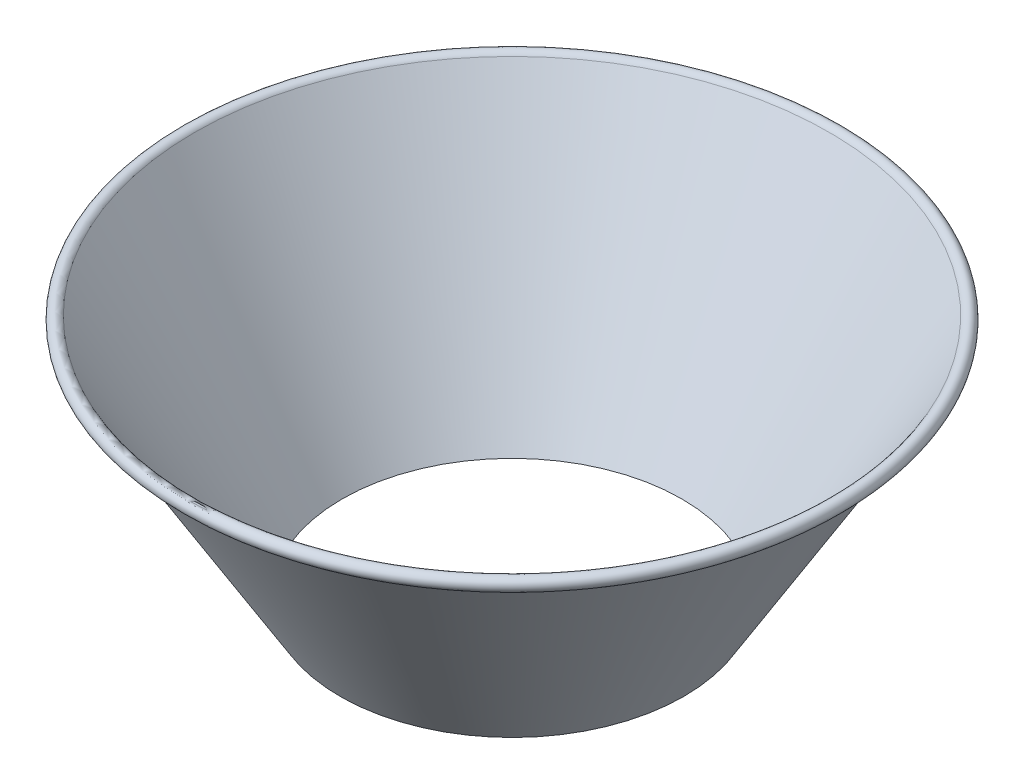
ISO-10303-21;
HEADER;
FILE_DESCRIPTION(('STEP AP214'),'2;1');
FILE_NAME('part.step','',(''),(''),'','','');
FILE_SCHEMA(('AUTOMOTIVE_DESIGN { 1 0 10303 214 1 1 1 1 }'));
ENDSEC;
DATA;
#1=APPLICATION_CONTEXT('core data for automotive mechanical design processes');
#2=APPLICATION_PROTOCOL_DEFINITION('international standard','automotive_design',2000,#1);
#3=PRODUCT_CONTEXT('',#1,'mechanical');
#4=PRODUCT('Part','Part','',(#3));
#5=PRODUCT_RELATED_PRODUCT_CATEGORY('part','',(#4));
#6=PRODUCT_DEFINITION_FORMATION('','',#4);
#7=PRODUCT_DEFINITION_CONTEXT('part definition',#1,'design');
#8=PRODUCT_DEFINITION('design','',#6,#7);
#9=PRODUCT_DEFINITION_SHAPE('','',#8);
#10=(LENGTH_UNIT() NAMED_UNIT(*) SI_UNIT(.MILLI.,.METRE.));
#11=(NAMED_UNIT(*) PLANE_ANGLE_UNIT() SI_UNIT($,.RADIAN.));
#12=(NAMED_UNIT(*) SI_UNIT($,.STERADIAN.) SOLID_ANGLE_UNIT());
#13=UNCERTAINTY_MEASURE_WITH_UNIT(LENGTH_MEASURE(1.E-05),#10,'distance_accuracy_value','');
#14=(GEOMETRIC_REPRESENTATION_CONTEXT(3) GLOBAL_UNCERTAINTY_ASSIGNED_CONTEXT((#13)) GLOBAL_UNIT_ASSIGNED_CONTEXT((#10,
#11,#12)) REPRESENTATION_CONTEXT('',''));
#15=CARTESIAN_POINT('',(0.,0.,0.));
#16=DIRECTION('',(0.,0.,1.));
#17=DIRECTION('',(1.,0.,0.));
#18=AXIS2_PLACEMENT_3D('',#15,#16,#17);
#19=CARTESIAN_POINT('',(0.,74.7395,0.));
#20=DIRECTION('',(0.,1.,0.));
#21=DIRECTION('',(-1.,0.,0.));
#22=AXIS2_PLACEMENT_3D('',#19,#20,#21);
#23=TOROIDAL_SURFACE('',#22,71.5645,1.46050000000002);
#24=CARTESIAN_POINT('',(0.,73.279,0.));
#25=DIRECTION('',(0.,1.,0.));
#26=DIRECTION('',(-1.,0.,0.));
#27=AXIS2_PLACEMENT_3D('',#24,#25,#26);
#28=CIRCLE('',#27,71.5645);
#29=CARTESIAN_POINT('',(-71.5645,73.279,0.));
#30=VERTEX_POINT('',#29);
#31=EDGE_CURVE('E72',#30,#30,#28,.T.);
#32=ORIENTED_EDGE('',*,*,#31,.T.);
#33=EDGE_LOOP('',(#32));
#34=FACE_BOUND('',#33,.T.);
#35=CARTESIAN_POINT('',(0.,75.4946142821155,0.));
#36=DIRECTION('',(0.,1.,0.));
#37=DIRECTION('',(-1.,0.,0.));
#38=AXIS2_PLACEMENT_3D('',#35,#36,#37);
#39=CIRCLE('',#38,70.3143549400388);
#40=CARTESIAN_POINT('',(-70.3143549400389,75.4946142821155,0.));
#41=VERTEX_POINT('',#40);
#42=EDGE_CURVE('E64',#41,#41,#39,.T.);
#43=ORIENTED_EDGE('',*,*,#42,.F.);
#44=EDGE_LOOP('',(#43));
#45=FACE_BOUND('',#44,.T.);
#46=ADVANCED_FACE('F40',(#34,#45),#23,.T.);
#47=CARTESIAN_POINT('',(0.,-18.669,0.));
#48=DIRECTION('',(0.,1.,0.));
#49=DIRECTION('',(-1.,0.,0.));
#50=AXIS2_PLACEMENT_3D('',#47,#48,#49);
#51=CONICAL_SURFACE('',#50,13.4375233807888,0.54337111564832);
#52=CARTESIAN_POINT('',(0.,21.4450023454756,0.));
#53=DIRECTION('',(0.,1.,0.));
#54=DIRECTION('',(0.,0.,1.));
#55=AXIS2_PLACEMENT_3D('',#52,#53,#54);
#56=CIRCLE('',#55,37.6672364389069);
#57=CARTESIAN_POINT('',(0.,21.4450023454756,37.667236438907));
#58=VERTEX_POINT('',#57);
#59=EDGE_CURVE('E69',#58,#58,#56,.T.);
#60=ORIENTED_EDGE('',*,*,#59,.F.);
#61=EDGE_LOOP('',(#60));
#62=FACE_BOUND('',#61,.T.);
#63=ORIENTED_EDGE('',*,*,#42,.T.);
#64=EDGE_LOOP('',(#63));
#65=FACE_BOUND('',#64,.T.);
#66=ADVANCED_FACE('F86',(#62,#65),#51,.F.);
#67=CARTESIAN_POINT('',(0.,75.2976279476506,0.));
#68=DIRECTION('',(0.,1.,0.));
#69=DIRECTION('',(-1.,0.,0.));
#70=AXIS2_PLACEMENT_3D('',#67,#68,#69);
#71=CONICAL_SURFACE('',#70,70.6404797382896,0.54337111564835);
#72=CARTESIAN_POINT('',(-38.0876548150612,168.081843546247,120.823003171525));
#73=CARTESIAN_POINT('',(-38.0876548150612,165.648551217745,119.281925192194));
#74=CARTESIAN_POINT('',(-38.0876548150612,163.216445597273,117.738971313603));
#75=CARTESIAN_POINT('',(-38.0876548150612,158.354939923969,114.648793918809));
#76=CARTESIAN_POINT('',(-38.0876548150612,155.925539877974,113.10157039185));
#77=CARTESIAN_POINT('',(-38.0876548150612,151.067729864395,110.001028867973));
#78=CARTESIAN_POINT('',(-38.0876548150612,148.63932248566,108.447706814018));
#79=CARTESIAN_POINT('',(-38.0876548150612,143.785983873332,105.335648390206));
#80=CARTESIAN_POINT('',(-38.0876548150612,141.361052634631,103.776912028318));
#81=CARTESIAN_POINT('',(-38.0876548150612,136.465336129185,100.621171617786));
#82=CARTESIAN_POINT('',(-38.0876548150612,133.994633245946,99.0240397281572));
#83=CARTESIAN_POINT('',(-38.0876548150612,129.057982270074,95.8224217122467));
#84=CARTESIAN_POINT('',(-38.0876548150612,126.592034195362,94.2179355583255));
#85=CARTESIAN_POINT('',(-38.0876548150612,121.667705356048,91.0018061663002));
#86=CARTESIAN_POINT('',(-38.0876548150612,119.209320031035,89.3901699129933));
#87=CARTESIAN_POINT('',(-38.0876548150612,114.299059973019,86.1570739835746));
#88=CARTESIAN_POINT('',(-38.0876548150612,111.847185154128,84.5356144379904));
#89=CARTESIAN_POINT('',(-38.0876548150612,107.691578120333,81.7733370093469));
#90=CARTESIAN_POINT('',(-38.0876548150612,105.985874445971,80.6354849650351));
#91=CARTESIAN_POINT('',(-38.0876548150612,102.578700330236,78.3534566396694));
#92=CARTESIAN_POINT('',(-38.0876548150612,100.877229890383,77.2092803563468));
#93=CARTESIAN_POINT('',(-38.0876548150612,97.4789926877367,74.9137084242104));
#94=CARTESIAN_POINT('',(-38.0876548150612,95.7822262588689,73.7623122808913));
#95=CARTESIAN_POINT('',(-38.0876548150612,92.3942223841081,71.451411131646));
#96=CARTESIAN_POINT('',(-38.0876548150612,90.7029849368961,70.2919061276548));
#97=CARTESIAN_POINT('',(-38.0876548150612,87.3219156311028,67.9601997255355));
#98=CARTESIAN_POINT('',(-38.0876548150612,85.6321026309994,66.7879709667249));
#99=CARTESIAN_POINT('',(-38.0876548150612,82.2599546885567,64.4327941320201));
#100=CARTESIAN_POINT('',(-38.0876548150612,80.5776197568551,63.2498460408844));
#101=CARTESIAN_POINT('',(-38.0876548150612,77.2221373154345,60.8718106736305));
#102=CARTESIAN_POINT('',(-38.0876548150612,75.5489877421685,59.6767263116331));
#103=CARTESIAN_POINT('',(-38.0876548150612,72.2131348110702,57.2720641664877));
#104=CARTESIAN_POINT('',(-38.0876548150612,70.5504314165469,56.0624864342891));
#105=CARTESIAN_POINT('',(-38.0876548150612,67.2611577528088,53.6435882695965));
#106=CARTESIAN_POINT('',(-38.0876548150612,65.6344100866802,52.4345093868182));
#107=CARTESIAN_POINT('',(-38.0876548150612,62.3957130032486,49.9966148906589));
#108=CARTESIAN_POINT('',(-38.0876548150612,60.7837638252043,48.7677989590535));
#109=CARTESIAN_POINT('',(-38.0876548150612,57.5765159062242,46.285252908823));
#110=CARTESIAN_POINT('',(-38.0876548150612,55.9812355222851,45.0314989979931));
#111=CARTESIAN_POINT('',(-38.0876548150612,53.6056695503966,43.1292605938618));
#112=CARTESIAN_POINT('',(-38.0876548150612,52.8167179509097,42.4915892528432));
#113=CARTESIAN_POINT('',(-38.0876548150612,51.245362842905,41.2082341776631));
#114=CARTESIAN_POINT('',(-38.0876548150612,50.4629592753172,40.5625505159113));
#115=CARTESIAN_POINT('',(-38.0876548150612,48.90970279517,39.2657102940267));
#116=CARTESIAN_POINT('',(-38.0876548150612,48.1388106833562,38.6146007211529));
#117=CARTESIAN_POINT('',(-38.0876548150612,46.6054343817125,37.3025395351501));
#118=CARTESIAN_POINT('',(-38.0876548150612,45.8429502201257,36.6415878889783));
#119=CARTESIAN_POINT('',(-38.0876548150612,44.327488840679,35.3085081185429));
#120=CARTESIAN_POINT('',(-38.0876548150612,43.5745138747313,34.6363774311122));
#121=CARTESIAN_POINT('',(-38.0876548150612,42.0798092000607,33.2797210155235));
#122=CARTESIAN_POINT('',(-38.0876548150612,41.3380793916203,32.5951953973967));
#123=CARTESIAN_POINT('',(-38.0876548150612,39.8690751711976,31.2133739506006));
#124=CARTESIAN_POINT('',(-38.0876548150612,39.1417773879191,30.5161030099));
#125=CARTESIAN_POINT('',(-38.0876548150612,37.7026087882811,29.1057224812742));
#126=CARTESIAN_POINT('',(-38.0876548150612,36.9907386001211,28.3926122507708));
#127=CARTESIAN_POINT('',(-38.0876548150612,35.5857654152034,26.9487713188204));
#128=CARTESIAN_POINT('',(-38.0876548150612,34.8926535854577,26.2180492281139));
#129=CARTESIAN_POINT('',(-38.0876548150612,33.5286480450629,24.7362133011933));
#130=CARTESIAN_POINT('',(-38.0876548150612,32.8577514147858,23.9851021684063));
#131=CARTESIAN_POINT('',(-38.0876548150612,32.0074562921743,22.9985014779341));
#132=CARTESIAN_POINT('',(-38.0876548150612,31.8156828965234,22.7736314110162));
#133=CARTESIAN_POINT('',(-38.0876548150612,31.4346035916423,22.3217873230872));
#134=CARTESIAN_POINT('',(-38.0876548150612,31.2452978094343,22.0948131947892));
#135=CARTESIAN_POINT('',(-38.0876548150612,30.8692839239541,21.6386519023495));
#136=CARTESIAN_POINT('',(-38.0876548150612,30.6825763068603,21.4094643372598));
#137=CARTESIAN_POINT('',(-38.0876548150612,30.3119668670527,20.9488378900014));
#138=CARTESIAN_POINT('',(-38.0876548150612,30.1280650127229,20.717399033249));
#139=CARTESIAN_POINT('',(-38.0876548150612,29.5806917865106,20.0193952128081));
#140=CARTESIAN_POINT('',(-38.0876548150612,29.2216888608861,19.5493076875629));
#141=CARTESIAN_POINT('',(-38.0876548150612,28.5172538154346,18.5990855641504));
#142=CARTESIAN_POINT('',(-38.0876548150612,28.1718211976454,18.1189513356395));
#143=CARTESIAN_POINT('',(-38.0876548150612,27.4995744361501,17.1524583187397));
#144=CARTESIAN_POINT('',(-38.0876548150612,27.172616106387,16.6662000825786));
#145=CARTESIAN_POINT('',(-38.0876548150612,26.5359991045371,15.6824348622619));
#146=CARTESIAN_POINT('',(-38.0876548150612,26.2263410227084,15.1849274951158));
#147=CARTESIAN_POINT('',(-38.0876548150612,25.62690664767,14.1782522848301));
#148=CARTESIAN_POINT('',(-38.0876548150612,25.3371238944485,13.6690883028568));
#149=CARTESIAN_POINT('',(-38.0876548150612,24.7801974310848,12.6385812415258));
#150=CARTESIAN_POINT('',(-38.0876548150612,24.5130509286648,12.1172396744756));
#151=CARTESIAN_POINT('',(-38.0876548150612,23.9400087042496,10.9282362893786));
#152=CARTESIAN_POINT('',(-38.0876548150612,23.6414652653594,10.2569943591806));
#153=CARTESIAN_POINT('',(-38.0876548150612,23.0918023706047,8.89535603427112));
#154=CARTESIAN_POINT('',(-38.0876548150612,22.8406746224838,8.20496301305006));
#155=CARTESIAN_POINT('',(-38.0876548150612,22.3934106131096,6.80768301408861));
#156=CARTESIAN_POINT('',(-38.0876548150612,22.1971860298175,6.10082453208847));
#157=CARTESIAN_POINT('',(-38.0876548150612,21.8660995361788,4.67260139782912));
#158=CARTESIAN_POINT('',(-38.0876548150612,21.7312377000805,3.95123672801865));
#159=CARTESIAN_POINT('',(-38.0876548150612,21.5785884070241,2.8587206712058));
#160=CARTESIAN_POINT('',(-38.0876548150612,21.5358914712146,2.49091772781046));
#161=CARTESIAN_POINT('',(-38.0876548150612,21.4679950496432,1.75371420860953));
#162=CARTESIAN_POINT('',(-38.0876548150612,21.4427934736389,1.38431382896435));
#163=CARTESIAN_POINT('',(-38.0876548150612,21.4101881093258,0.644710053627098));
#164=CARTESIAN_POINT('',(-38.0876548150612,21.4027853865662,0.27450661118658));
#165=CARTESIAN_POINT('',(-38.0876548150612,21.4058635883615,-0.465784828071986));
#166=CARTESIAN_POINT('',(-38.0876548150612,21.4163425347696,-0.835872833130432));
#167=CARTESIAN_POINT('',(-38.0876548150612,21.4550805517603,-1.57549750378557));
#168=CARTESIAN_POINT('',(-38.0876548150612,21.4833576986873,-1.94503322553982));
#169=CARTESIAN_POINT('',(-38.0876548150612,21.5573635637012,-2.68230918303501));
#170=CARTESIAN_POINT('',(-38.0876548150612,21.6030915844276,-3.05004948992848));
#171=CARTESIAN_POINT('',(-38.0876548150612,21.7657485021896,-4.14954741396918));
#172=CARTESIAN_POINT('',(-38.0876548150612,21.9081544416412,-4.87765883774081));
#173=CARTESIAN_POINT('',(-38.0876548150612,22.286713845738,-6.45014912277065));
#174=CARTESIAN_POINT('',(-38.0876548150612,22.5352281696663,-7.29151420852141));
#175=CARTESIAN_POINT('',(-38.0876548150612,23.1072123330818,-8.94859944125409));
#176=CARTESIAN_POINT('',(-38.0876548150612,23.430722530745,-9.7643055107449));
#177=CARTESIAN_POINT('',(-38.0876548150612,23.9632573727241,-10.9676286382808));
#178=CARTESIAN_POINT('',(-38.0876548150612,24.1489015353092,-11.36583492349));
#179=CARTESIAN_POINT('',(-38.0876548150612,24.5344190314017,-12.1551061446125));
#180=CARTESIAN_POINT('',(-38.0876548150612,24.7342861317781,-12.5461741155871));
#181=CARTESIAN_POINT('',(-38.0876548150612,25.1469691607501,-13.3213979739704));
#182=CARTESIAN_POINT('',(-38.0876548150612,25.3597852401153,-13.7055537808306));
#183=CARTESIAN_POINT('',(-38.0876548150612,25.7971716602247,-14.467179829362));
#184=CARTESIAN_POINT('',(-38.0876548150612,26.0217438238315,-14.8446490220101));
#185=CARTESIAN_POINT('',(-38.0876548150612,26.5521746246227,-15.7081245746477));
#186=CARTESIAN_POINT('',(-38.0876548150612,26.8617967781157,-16.1918197574383));
#187=CARTESIAN_POINT('',(-38.0876548150612,27.4969698248948,-17.1486733667581));
#188=CARTESIAN_POINT('',(-38.0876548150612,27.8225224516449,-17.6218306384235));
#189=CARTESIAN_POINT('',(-38.0876548150612,28.4877183939495,-18.5583560295845));
#190=CARTESIAN_POINT('',(-38.0876548150612,28.8273663966491,-19.0217208142102));
#191=CARTESIAN_POINT('',(-38.0876548150612,29.5190087914117,-19.93915807313));
#192=CARTESIAN_POINT('',(-38.0876548150612,29.8710039378488,-20.3932299769633));
#193=CARTESIAN_POINT('',(-38.0876548150612,30.9445786702881,-21.7440676898729));
#194=CARTESIAN_POINT('',(-38.0876548150612,31.682572602163,-22.6278205644663));
#195=CARTESIAN_POINT('',(-38.0876548150612,33.1927304890754,-24.3651391391388));
#196=CARTESIAN_POINT('',(-38.0876548150612,33.9648890431293,-25.218709572556));
#197=CARTESIAN_POINT('',(-38.0876548150612,35.542250974783,-26.9059763205005));
#198=CARTESIAN_POINT('',(-38.0876548150612,36.3476488399635,-27.7394902421869));
#199=CARTESIAN_POINT('',(-38.0876548150612,37.9810836623691,-29.3840175024714));
#200=CARTESIAN_POINT('',(-38.0876548150612,38.8091213304774,-30.1950301329209));
#201=CARTESIAN_POINT('',(-38.0876548150612,40.0646253535695,-31.3964482639423));
#202=CARTESIAN_POINT('',(-38.0876548150612,40.4851199797169,-31.794177683662));
#203=CARTESIAN_POINT('',(-38.0876548150612,41.3303514264109,-32.585105822505));
#204=CARTESIAN_POINT('',(-38.0876548150612,41.7550882438685,-32.9783045449269));
#205=CARTESIAN_POINT('',(-38.0876548150612,42.6084144453573,-33.7604610722337));
#206=CARTESIAN_POINT('',(-38.0876548150612,43.0370036736449,-34.1494190471673));
#207=CARTESIAN_POINT('',(-38.0876548150612,43.8977292952155,-34.9233873701068));
#208=CARTESIAN_POINT('',(-38.0876548150612,44.3298656906494,-35.3083977157187));
#209=CARTESIAN_POINT('',(-38.0876548150612,45.7303822371663,-36.5455584352396));
#210=CARTESIAN_POINT('',(-38.0876548150612,46.7052211566683,-37.3904085111028));
#211=CARTESIAN_POINT('',(-38.0876548150612,48.6683914288737,-39.0643103878748));
#212=CARTESIAN_POINT('',(-38.0876548150612,49.6567232605886,-39.8933616253933));
#213=CARTESIAN_POINT('',(-38.0876548150612,51.6448991790498,-41.537797394244));
#214=CARTESIAN_POINT('',(-38.0876548150612,52.6447447612912,-42.3531801156429));
#215=CARTESIAN_POINT('',(-38.0876548150612,54.6541330703226,-43.9718700072769));
#216=CARTESIAN_POINT('',(-38.0876548150612,55.6636756899806,-44.7751773106694));
#217=CARTESIAN_POINT('',(-38.0876548150612,57.69164520394,-46.3715814614122));
#218=CARTESIAN_POINT('',(-38.0876548150612,58.7100764474548,-47.164672778768));
#219=CARTESIAN_POINT('',(-38.0876548150612,60.7541989883781,-48.7414407856736));
#220=CARTESIAN_POINT('',(-38.0876548150612,61.7798903033331,-49.5251174524571));
#221=CARTESIAN_POINT('',(-38.0876548150612,63.8375450094514,-51.0840430733263));
#222=CARTESIAN_POINT('',(-38.0876548150612,64.8695079735142,-51.8592925914943));
#223=CARTESIAN_POINT('',(-38.0876548150612,66.9390185140117,-53.402305015757));
#224=CARTESIAN_POINT('',(-38.0876548150612,67.9765661160299,-54.1700678875096));
#225=CARTESIAN_POINT('',(-38.0876548150612,71.1005690222989,-56.4662274285432));
#226=CARTESIAN_POINT('',(-38.0876548150612,73.1944513505573,-57.9845253186376));
#227=CARTESIAN_POINT('',(-38.0876548150612,77.3979095083253,-60.9992450480099));
#228=CARTESIAN_POINT('',(-38.0876548150612,79.5074855404084,-62.4956666041677));
#229=CARTESIAN_POINT('',(-38.0876548150612,83.7387286800812,-65.469976648136));
#230=CARTESIAN_POINT('',(-38.0876548150612,85.8603920666994,-66.9478704339351));
#231=CARTESIAN_POINT('',(-38.0876548150612,90.1141541167086,-69.8885274232925));
#232=CARTESIAN_POINT('',(-38.0876548150612,92.246252732832,-71.351290695293));
#233=CARTESIAN_POINT('',(-38.0876548150612,96.5135561602564,-74.2602158828722));
#234=CARTESIAN_POINT('',(-38.0876548150612,98.6487381703079,-75.7064112701764));
#235=CARTESIAN_POINT('',(-38.0876548150612,102.926410209795,-78.587950050575));
#236=CARTESIAN_POINT('',(-38.0876548150612,105.068900244187,-80.0232934363084));
#237=CARTESIAN_POINT('',(-38.0876548150612,109.360249525592,-82.8847355799604));
#238=CARTESIAN_POINT('',(-38.0876548150612,111.509109190085,-84.3108337114878));
#239=CARTESIAN_POINT('',(-38.0876548150612,115.812180793713,-87.1549299326753));
#240=CARTESIAN_POINT('',(-38.0876548150612,117.966392733977,-88.572928020624));
#241=CARTESIAN_POINT('',(-38.0876548150612,122.277573330156,-91.4006195682699));
#242=CARTESIAN_POINT('',(-38.0876548150612,124.434537945681,-92.810319190041));
#243=CARTESIAN_POINT('',(-38.0876548150612,128.752508001349,-95.6235183322525));
#244=CARTESIAN_POINT('',(-38.0876548150612,130.913513444746,-97.0270178476958));
#245=CARTESIAN_POINT('',(-38.0876548150612,135.239073336351,-99.8285399569471));
#246=CARTESIAN_POINT('',(-38.0876548150612,137.403627787571,-101.226562546104));
#247=CARTESIAN_POINT('',(-38.0876548150612,141.735870250438,-104.017744210696));
#248=CARTESIAN_POINT('',(-38.0876548150612,143.903558262736,-105.410903285122));
#249=CARTESIAN_POINT('',(-38.0876548150612,147.903233550735,-107.975818793963));
#250=CARTESIAN_POINT('',(-38.0876548150612,149.734820514643,-109.148199620322));
#251=CARTESIAN_POINT('',(-38.0876548150612,153.400011698694,-111.490282238694));
#252=CARTESIAN_POINT('',(-38.0876548150612,155.233616131932,-112.659983697208));
#253=CARTESIAN_POINT('',(-38.0876548150612,158.902237123805,-114.996668119682));
#254=CARTESIAN_POINT('',(-38.0876548150612,160.737253479563,-116.163651402205));
#255=CARTESIAN_POINT('',(-38.0876548150612,164.408567522735,-118.495115966791));
#256=CARTESIAN_POINT('',(-38.0876548150612,166.244865030971,-119.659597530988));
#257=CARTESIAN_POINT('',(-38.0876548150612,168.081843546247,-120.823003171525));
#258=B_SPLINE_CURVE_WITH_KNOTS('',3,(#72,#73,#74,#75,#76,#77,#78,#79,#80,#81,#82,#83,#84,#85,
#86,#87,#88,#89,#90,#91,#92,#93,#94,#95,#96,#97,#98,#99,#100,#101,#102,#103,#104,#105,#106,#107,
#108,#109,#110,#111,#112,#113,#114,#115,#116,#117,#118,#119,#120,#121,#122,#123,#124,#125,#126,
#127,#128,#129,#130,#131,#132,#133,#134,#135,#136,#137,#138,#139,#140,#141,#142,#143,#144,#145,
#146,#147,#148,#149,#150,#151,#152,#153,#154,#155,#156,#157,#158,#159,#160,#161,#162,#163,#164,
#165,#166,#167,#168,#169,#170,#171,#172,#173,#174,#175,#176,#177,#178,#179,#180,#181,#182,#183,
#184,#185,#186,#187,#188,#189,#190,#191,#192,#193,#194,#195,#196,#197,#198,#199,#200,#201,#202,
#203,#204,#205,#206,#207,#208,#209,#210,#211,#212,#213,#214,#215,#216,#217,#218,#219,#220,#221,
#222,#223,#224,#225,#226,#227,#228,#229,#230,#231,#232,#233,#234,#235,#236,#237,#238,#239,#240,
#241,#242,#243,#244,#245,#246,#247,#248,#249,#250,#251,#252,#253,#254,#255,#256,#257),
.UNSPECIFIED.,.F.,.F.,(4,2,2,2,2,2,2,2,2,2,2,2,2,2,2,2,2,2,2,2,2,2,2,2,2,2,2,2,2,2,2,2,2,2,2,2,
2,2,2,2,2,2,2,2,2,2,2,2,2,2,2,2,2,2,2,2,2,2,2,2,2,2,2,2,2,2,2,2,2,2,2,2,2,2,2,2,2,2,2,2,2,2,2,2,
2,2,2,2,2,2,2,2,4),(0.,8.64074711120191,17.281516013061,25.9296161269713,34.5777035186858,
43.403610183124,52.2295500457246,61.0482191779913,69.8667713875769,76.0179537593442,
82.169138337896,88.3207489306777,94.4723580556549,100.642111183688,106.811873085606,
112.980186996667,119.14847923021,125.228946097038,131.309511099021,137.396185600915,
140.439434782314,143.482656480928,146.509787761551,149.536929207449,152.564774565246,
155.592593057646,158.615024394013,161.637578571032,164.658683802168,167.67939039643,
168.565996385422,169.452647834234,170.339463023956,171.22626821344,173.000519376337,
174.774705372175,176.532258644442,178.289871845157,180.046911040639,181.803733181367,
184.006050965348,186.207983241227,188.406352658748,190.604724736269,191.715194829519,
192.825532227511,193.935936095493,195.046217133804,196.157627627806,197.268993713006,
199.491496051763,202.119336141011,204.748593668793,206.066427127575,207.383686567532,
208.70096134775,210.018440989085,211.740984695192,213.463716257382,215.187025344403,
216.910439904546,220.363302074847,223.815620329222,227.29226181542,230.769012592805,
232.505373419093,234.2417329811,235.978022659247,237.714313390274,241.584070491386,
245.453965331725,249.324368624374,253.194729206188,257.067103546869,260.939487249779,
264.811610133466,268.683750770661,276.442815757678,284.201981072632,291.958874593126,
299.71573301024,307.452253555296,315.188779347652,322.92582394455,330.662870176123,
338.393171479446,346.123479011942,353.853793107961,361.584108808267,368.108114755738,
374.632892847908,381.156863335057,387.68005476384),.UNSPECIFIED.);
#259=CARTESIAN_POINT('',(-38.0876548150612,21.4450023454756,1.37164360702084));
#260=VERTEX_POINT('',#259);
#261=CARTESIAN_POINT('',(-38.0876548150612,21.4450023454756,-1.37164360702086));
#262=VERTEX_POINT('',#261);
#263=EDGE_CURVE('E11',#260,#262,#258,.T.);
#264=ORIENTED_EDGE('',*,*,#263,.F.);
#265=CARTESIAN_POINT('',(0.,21.4450023454756,0.));
#266=DIRECTION('',(0.,1.,0.));
#267=DIRECTION('',(0.,0.,1.));
#268=AXIS2_PLACEMENT_3D('',#265,#266,#267);
#269=CIRCLE('',#268,38.1123451849388);
#270=EDGE_CURVE('E53',#262,#260,#269,.F.);
#271=ORIENTED_EDGE('',*,*,#270,.F.);
#272=EDGE_LOOP('',(#264,#271));
#273=FACE_BOUND('',#272,.T.);
#274=CARTESIAN_POINT('',(0.,75.2976279476506,0.));
#275=DIRECTION('',(0.,1.,0.));
#276=DIRECTION('',(-1.,0.,0.));
#277=AXIS2_PLACEMENT_3D('',#274,#275,#276);
#278=CIRCLE('',#277,70.6404797382896);
#279=CARTESIAN_POINT('',(-70.6404797382896,75.2976279476506,0.));
#280=VERTEX_POINT('',#279);
#281=EDGE_CURVE('E80',#280,#280,#278,.T.);
#282=ORIENTED_EDGE('',*,*,#281,.F.);
#283=EDGE_LOOP('',(#282));
#284=FACE_BOUND('',#283,.T.);
#285=ADVANCED_FACE('F62',(#273,#284),#71,.T.);
#286=CARTESIAN_POINT('',(0.,74.7395,0.));
#287=DIRECTION('',(0.,1.,0.));
#288=DIRECTION('',(-1.,0.,0.));
#289=AXIS2_PLACEMENT_3D('',#286,#287,#288);
#290=TOROIDAL_SURFACE('',#289,71.5645,1.07949999999998);
#291=ORIENTED_EDGE('',*,*,#281,.T.);
#292=EDGE_LOOP('',(#291));
#293=FACE_BOUND('',#292,.T.);
#294=CARTESIAN_POINT('',(0.,73.66,0.));
#295=DIRECTION('',(0.,1.,0.));
#296=DIRECTION('',(-1.,0.,0.));
#297=AXIS2_PLACEMENT_3D('',#294,#295,#296);
#298=CIRCLE('',#297,71.5645);
#299=CARTESIAN_POINT('',(-71.5645,73.66,0.));
#300=VERTEX_POINT('',#299);
#301=EDGE_CURVE('E77',#300,#300,#298,.T.);
#302=ORIENTED_EDGE('',*,*,#301,.F.);
#303=EDGE_LOOP('',(#302));
#304=FACE_BOUND('',#303,.T.);
#305=ADVANCED_FACE('F98',(#293,#304),#290,.F.);
#306=CARTESIAN_POINT('',(0.,76.2,0.));
#307=DIRECTION('',(0.,1.,0.));
#308=DIRECTION('',(-1.,0.,0.));
#309=AXIS2_PLACEMENT_3D('',#306,#307,#308);
#310=CYLINDRICAL_SURFACE('',#309,71.5645);
#311=ORIENTED_EDGE('',*,*,#301,.T.);
#312=EDGE_LOOP('',(#311));
#313=FACE_BOUND('',#312,.T.);
#314=ORIENTED_EDGE('',*,*,#31,.F.);
#315=EDGE_LOOP('',(#314));
#316=FACE_BOUND('',#315,.T.);
#317=ADVANCED_FACE('F96',(#313,#316),#310,.F.);
#318=CARTESIAN_POINT('',(-38.0876548150612,21.4450023454756,-73.025));
#319=DIRECTION('',(-1.,0.,0.));
#320=DIRECTION('',(0.,0.,1.));
#321=AXIS2_PLACEMENT_3D('',#318,#319,#320);
#322=PLANE('',#321);
#323=ORIENTED_EDGE('',*,*,#263,.T.);
#324=DIRECTION('',(0.,0.,1.));
#325=VECTOR('',#324,1.);
#326=CARTESIAN_POINT('',(-38.0876548150612,21.4450023454756,-73.025));
#327=LINE('',#326,#325);
#328=EDGE_CURVE('E67',#262,#260,#327,.T.);
#329=ORIENTED_EDGE('',*,*,#328,.T.);
#330=EDGE_LOOP('',(#323,#329));
#331=FACE_BOUND('',#330,.T.);
#332=ADVANCED_FACE('F66',(#331),#322,.F.);
#333=CARTESIAN_POINT('',(38.1123451849388,21.4450023454756,-73.025));
#334=DIRECTION('',(0.,1.,0.));
#335=DIRECTION('',(0.,0.,1.));
#336=AXIS2_PLACEMENT_3D('',#333,#334,#335);
#337=PLANE('',#336);
#338=ORIENTED_EDGE('',*,*,#59,.T.);
#339=EDGE_LOOP('',(#338));
#340=FACE_BOUND('',#339,.T.);
#341=ORIENTED_EDGE('',*,*,#328,.F.);
#342=ORIENTED_EDGE('',*,*,#270,.T.);
#343=EDGE_LOOP('',(#341,#342));
#344=FACE_BOUND('',#343,.T.);
#345=ADVANCED_FACE('F68',(#340,#344),#337,.F.);
#346=CLOSED_SHELL('',(#46,#66,#285,#305,#317,#332,#345));
#347=MANIFOLD_SOLID_BREP('B2',#346);
#348=ADVANCED_BREP_SHAPE_REPRESENTATION('',(#18,#347),#14);
#349=SHAPE_DEFINITION_REPRESENTATION(#9,#348);
ENDSEC;
END-ISO-10303-21;
